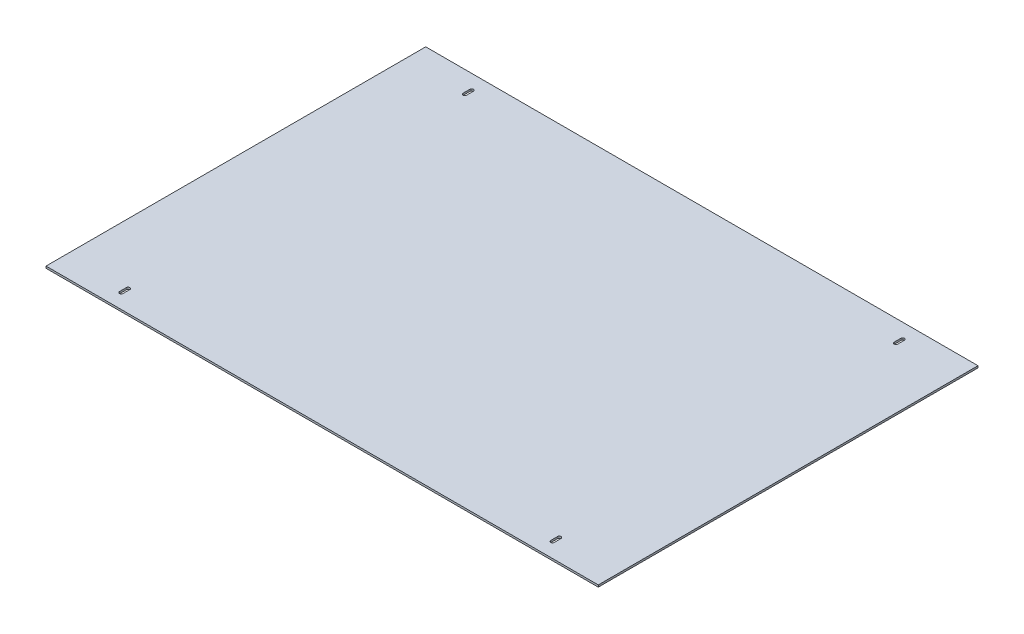
ISO-10303-21;
HEADER;
FILE_DESCRIPTION(('STEP AP214'),'2;1');
FILE_NAME('part.step','',(''),(''),'','','');
FILE_SCHEMA(('AUTOMOTIVE_DESIGN { 1 0 10303 214 1 1 1 1 }'));
ENDSEC;
DATA;
#1=APPLICATION_CONTEXT('core data for automotive mechanical design processes');
#2=APPLICATION_PROTOCOL_DEFINITION('international standard','automotive_design',2000,#1);
#3=PRODUCT_CONTEXT('',#1,'mechanical');
#4=PRODUCT('Part','Part','',(#3));
#5=PRODUCT_RELATED_PRODUCT_CATEGORY('part','',(#4));
#6=PRODUCT_DEFINITION_FORMATION('','',#4);
#7=PRODUCT_DEFINITION_CONTEXT('part definition',#1,'design');
#8=PRODUCT_DEFINITION('design','',#6,#7);
#9=PRODUCT_DEFINITION_SHAPE('','',#8);
#10=(LENGTH_UNIT() NAMED_UNIT(*) SI_UNIT(.MILLI.,.METRE.));
#11=(NAMED_UNIT(*) PLANE_ANGLE_UNIT() SI_UNIT($,.RADIAN.));
#12=(NAMED_UNIT(*) SI_UNIT($,.STERADIAN.) SOLID_ANGLE_UNIT());
#13=UNCERTAINTY_MEASURE_WITH_UNIT(LENGTH_MEASURE(1.E-05),#10,'distance_accuracy_value','');
#14=(GEOMETRIC_REPRESENTATION_CONTEXT(3) GLOBAL_UNCERTAINTY_ASSIGNED_CONTEXT((#13)) GLOBAL_UNIT_ASSIGNED_CONTEXT((#10,
#11,#12)) REPRESENTATION_CONTEXT('',''));
#15=CARTESIAN_POINT('',(0.,0.,0.));
#16=DIRECTION('',(0.,0.,1.));
#17=DIRECTION('',(1.,0.,0.));
#18=AXIS2_PLACEMENT_3D('',#15,#16,#17);
#19=CARTESIAN_POINT('',(357.886,2.54,246.0625));
#20=DIRECTION('',(-1.,0.,0.));
#21=DIRECTION('',(0.,0.,1.));
#22=AXIS2_PLACEMENT_3D('',#19,#20,#21);
#23=PLANE('',#22);
#24=DIRECTION('',(0.,0.,-1.));
#25=VECTOR('',#24,1.);
#26=CARTESIAN_POINT('',(357.886,0.,246.0625));
#27=LINE('',#26,#25);
#28=CARTESIAN_POINT('',(357.886,0.,246.0625));
#29=VERTEX_POINT('',#28);
#30=CARTESIAN_POINT('',(357.886,0.,-246.0625));
#31=VERTEX_POINT('',#30);
#32=EDGE_CURVE('E295',#29,#31,#27,.T.);
#33=ORIENTED_EDGE('',*,*,#32,.T.);
#34=DIRECTION('',(0.,-1.,0.));
#35=VECTOR('',#34,1.);
#36=CARTESIAN_POINT('',(357.886,2.54,-246.0625));
#37=LINE('',#36,#35);
#38=CARTESIAN_POINT('',(357.886,2.54,-246.0625));
#39=VERTEX_POINT('',#38);
#40=EDGE_CURVE('E11',#39,#31,#37,.T.);
#41=ORIENTED_EDGE('',*,*,#40,.F.);
#42=DIRECTION('',(0.,0.,-1.));
#43=VECTOR('',#42,1.);
#44=CARTESIAN_POINT('',(357.886,2.54,246.0625));
#45=LINE('',#44,#43);
#46=CARTESIAN_POINT('',(357.886,2.54,246.0625));
#47=VERTEX_POINT('',#46);
#48=EDGE_CURVE('E302',#47,#39,#45,.T.);
#49=ORIENTED_EDGE('',*,*,#48,.F.);
#50=DIRECTION('',(0.,-1.,0.));
#51=VECTOR('',#50,1.);
#52=CARTESIAN_POINT('',(357.886,2.54,246.0625));
#53=LINE('',#52,#51);
#54=EDGE_CURVE('E312',#47,#29,#53,.T.);
#55=ORIENTED_EDGE('',*,*,#54,.T.);
#56=EDGE_LOOP('',(#33,#41,#49,#55));
#57=FACE_BOUND('',#56,.T.);
#58=ADVANCED_FACE('F33',(#57),#23,.F.);
#59=CARTESIAN_POINT('',(-357.886,2.54,-246.0625));
#60=DIRECTION('',(0.,0.,1.));
#61=DIRECTION('',(1.,0.,0.));
#62=AXIS2_PLACEMENT_3D('',#59,#60,#61);
#63=PLANE('',#62);
#64=DIRECTION('',(-1.,0.,0.));
#65=VECTOR('',#64,1.);
#66=CARTESIAN_POINT('',(-357.886,0.,-246.0625));
#67=LINE('',#66,#65);
#68=CARTESIAN_POINT('',(-357.886,0.,-246.0625));
#69=VERTEX_POINT('',#68);
#70=EDGE_CURVE('E315',#31,#69,#67,.T.);
#71=ORIENTED_EDGE('',*,*,#70,.T.);
#72=DIRECTION('',(0.,-1.,0.));
#73=VECTOR('',#72,1.);
#74=CARTESIAN_POINT('',(-357.886,2.54,-246.0625));
#75=LINE('',#74,#73);
#76=CARTESIAN_POINT('',(-357.886,2.54,-246.0625));
#77=VERTEX_POINT('',#76);
#78=EDGE_CURVE('E40',#77,#69,#75,.T.);
#79=ORIENTED_EDGE('',*,*,#78,.F.);
#80=DIRECTION('',(-1.,0.,0.));
#81=VECTOR('',#80,1.);
#82=CARTESIAN_POINT('',(-357.886,2.54,-246.0625));
#83=LINE('',#82,#81);
#84=EDGE_CURVE('E305',#39,#77,#83,.T.);
#85=ORIENTED_EDGE('',*,*,#84,.F.);
#86=ORIENTED_EDGE('',*,*,#40,.T.);
#87=EDGE_LOOP('',(#71,#79,#85,#86));
#88=FACE_BOUND('',#87,.T.);
#89=ADVANCED_FACE('F344',(#88),#63,.F.);
#90=CARTESIAN_POINT('',(-357.886,2.54,246.0625));
#91=DIRECTION('',(1.,0.,0.));
#92=DIRECTION('',(0.,0.,-1.));
#93=AXIS2_PLACEMENT_3D('',#90,#91,#92);
#94=PLANE('',#93);
#95=DIRECTION('',(0.,0.,1.));
#96=VECTOR('',#95,1.);
#97=CARTESIAN_POINT('',(-357.886,0.,246.0625));
#98=LINE('',#97,#96);
#99=CARTESIAN_POINT('',(-357.886,0.,246.0625));
#100=VERTEX_POINT('',#99);
#101=EDGE_CURVE('E317',#69,#100,#98,.T.);
#102=ORIENTED_EDGE('',*,*,#101,.T.);
#103=DIRECTION('',(0.,-1.,0.));
#104=VECTOR('',#103,1.);
#105=CARTESIAN_POINT('',(-357.886,2.54,246.0625));
#106=LINE('',#105,#104);
#107=CARTESIAN_POINT('',(-357.886,2.54,246.0625));
#108=VERTEX_POINT('',#107);
#109=EDGE_CURVE('E322',#108,#100,#106,.T.);
#110=ORIENTED_EDGE('',*,*,#109,.F.);
#111=DIRECTION('',(0.,0.,1.));
#112=VECTOR('',#111,1.);
#113=CARTESIAN_POINT('',(-357.886,2.54,246.0625));
#114=LINE('',#113,#112);
#115=EDGE_CURVE('E308',#77,#108,#114,.T.);
#116=ORIENTED_EDGE('',*,*,#115,.F.);
#117=ORIENTED_EDGE('',*,*,#78,.T.);
#118=EDGE_LOOP('',(#102,#110,#116,#117));
#119=FACE_BOUND('',#118,.T.);
#120=ADVANCED_FACE('F329',(#119),#94,.F.);
#121=CARTESIAN_POINT('',(-357.886,2.54,246.0625));
#122=DIRECTION('',(0.,0.,-1.));
#123=DIRECTION('',(-1.,0.,0.));
#124=AXIS2_PLACEMENT_3D('',#121,#122,#123);
#125=PLANE('',#124);
#126=DIRECTION('',(1.,0.,0.));
#127=VECTOR('',#126,1.);
#128=CARTESIAN_POINT('',(-357.886,0.,246.0625));
#129=LINE('',#128,#127);
#130=EDGE_CURVE('E306',#100,#29,#129,.T.);
#131=ORIENTED_EDGE('',*,*,#130,.T.);
#132=ORIENTED_EDGE('',*,*,#54,.F.);
#133=DIRECTION('',(1.,0.,0.));
#134=VECTOR('',#133,1.);
#135=CARTESIAN_POINT('',(-357.886,2.54,246.0625));
#136=LINE('',#135,#134);
#137=EDGE_CURVE('E310',#108,#47,#136,.T.);
#138=ORIENTED_EDGE('',*,*,#137,.F.);
#139=ORIENTED_EDGE('',*,*,#109,.T.);
#140=EDGE_LOOP('',(#131,#132,#138,#139));
#141=FACE_BOUND('',#140,.T.);
#142=ADVANCED_FACE('F337',(#141),#125,.F.);
#143=CARTESIAN_POINT('',(0.,2.54,0.));
#144=DIRECTION('',(0.,-1.,0.));
#145=DIRECTION('',(0.,0.,-1.));
#146=AXIS2_PLACEMENT_3D('',#143,#144,#145);
#147=PLANE('',#146);
#148=DIRECTION('',(0.,0.,1.));
#149=VECTOR('',#148,1.);
#150=CARTESIAN_POINT('',(-281.6479,2.54,218.1225));
#151=LINE('',#150,#149);
#152=CARTESIAN_POINT('',(-281.6479,2.54,218.1225));
#153=VERTEX_POINT('',#152);
#154=CARTESIAN_POINT('',(-281.6479,2.54,227.0125));
#155=VERTEX_POINT('',#154);
#156=EDGE_CURVE('E196',#153,#155,#151,.T.);
#157=ORIENTED_EDGE('',*,*,#156,.F.);
#158=CARTESIAN_POINT('',(-279.4,2.54,218.1225));
#159=DIRECTION('',(0.,1.,0.));
#160=DIRECTION('',(0.,0.,1.));
#161=AXIS2_PLACEMENT_3D('',#158,#159,#160);
#162=CIRCLE('',#161,2.24789999999997);
#163=CARTESIAN_POINT('',(-277.1521,2.54,218.1225));
#164=VERTEX_POINT('',#163);
#165=EDGE_CURVE('E47',#164,#153,#162,.T.);
#166=ORIENTED_EDGE('',*,*,#165,.F.);
#167=DIRECTION('',(0.,0.,-1.));
#168=VECTOR('',#167,1.);
#169=CARTESIAN_POINT('',(-277.1521,2.54,218.1225));
#170=LINE('',#169,#168);
#171=CARTESIAN_POINT('',(-277.1521,2.54,227.0125));
#172=VERTEX_POINT('',#171);
#173=EDGE_CURVE('E187',#172,#164,#170,.T.);
#174=ORIENTED_EDGE('',*,*,#173,.F.);
#175=CARTESIAN_POINT('',(-279.4,2.54,227.0125));
#176=DIRECTION('',(0.,1.,0.));
#177=DIRECTION('',(0.,0.,1.));
#178=AXIS2_PLACEMENT_3D('',#175,#176,#177);
#179=CIRCLE('',#178,2.24789999999997);
#180=EDGE_CURVE('E190',#155,#172,#179,.T.);
#181=ORIENTED_EDGE('',*,*,#180,.F.);
#182=EDGE_LOOP('',(#157,#166,#174,#181));
#183=FACE_BOUND('',#182,.T.);
#184=DIRECTION('',(0.,0.,1.));
#185=VECTOR('',#184,1.);
#186=CARTESIAN_POINT('',(277.1521,2.54,218.1225));
#187=LINE('',#186,#185);
#188=CARTESIAN_POINT('',(277.1521,2.54,218.1225));
#189=VERTEX_POINT('',#188);
#190=CARTESIAN_POINT('',(277.1521,2.54,227.0125));
#191=VERTEX_POINT('',#190);
#192=EDGE_CURVE('E221',#189,#191,#187,.T.);
#193=ORIENTED_EDGE('',*,*,#192,.F.);
#194=CARTESIAN_POINT('',(279.4,2.54,218.1225));
#195=DIRECTION('',(0.,1.,0.));
#196=DIRECTION('',(0.,0.,-1.));
#197=AXIS2_PLACEMENT_3D('',#194,#195,#196);
#198=CIRCLE('',#197,2.24789999999997);
#199=CARTESIAN_POINT('',(281.6479,2.54,218.1225));
#200=VERTEX_POINT('',#199);
#201=EDGE_CURVE('E202',#200,#189,#198,.T.);
#202=ORIENTED_EDGE('',*,*,#201,.F.);
#203=DIRECTION('',(0.,0.,-1.));
#204=VECTOR('',#203,1.);
#205=CARTESIAN_POINT('',(281.6479,2.54,218.1225));
#206=LINE('',#205,#204);
#207=CARTESIAN_POINT('',(281.6479,2.54,227.0125));
#208=VERTEX_POINT('',#207);
#209=EDGE_CURVE('E210',#208,#200,#206,.T.);
#210=ORIENTED_EDGE('',*,*,#209,.F.);
#211=CARTESIAN_POINT('',(279.4,2.54,227.0125));
#212=DIRECTION('',(0.,1.,0.));
#213=DIRECTION('',(0.,0.,-1.));
#214=AXIS2_PLACEMENT_3D('',#211,#212,#213);
#215=CIRCLE('',#214,2.24789999999997);
#216=EDGE_CURVE('E224',#191,#208,#215,.T.);
#217=ORIENTED_EDGE('',*,*,#216,.F.);
#218=EDGE_LOOP('',(#193,#202,#210,#217));
#219=FACE_BOUND('',#218,.T.);
#220=DIRECTION('',(0.,0.,-1.));
#221=VECTOR('',#220,1.);
#222=CARTESIAN_POINT('',(-277.1521,2.54,-218.1225));
#223=LINE('',#222,#221);
#224=CARTESIAN_POINT('',(-277.1521,2.54,-218.1225));
#225=VERTEX_POINT('',#224);
#226=CARTESIAN_POINT('',(-277.1521,2.54,-227.0125));
#227=VERTEX_POINT('',#226);
#228=EDGE_CURVE('E253',#225,#227,#223,.T.);
#229=ORIENTED_EDGE('',*,*,#228,.F.);
#230=CARTESIAN_POINT('',(-279.4,2.54,-218.1225));
#231=DIRECTION('',(0.,1.,0.));
#232=DIRECTION('',(0.,0.,-1.));
#233=AXIS2_PLACEMENT_3D('',#230,#231,#232);
#234=CIRCLE('',#233,2.24789999999997);
#235=CARTESIAN_POINT('',(-281.6479,2.54,-218.1225));
#236=VERTEX_POINT('',#235);
#237=EDGE_CURVE('E231',#236,#225,#234,.T.);
#238=ORIENTED_EDGE('',*,*,#237,.F.);
#239=DIRECTION('',(0.,0.,1.));
#240=VECTOR('',#239,1.);
#241=CARTESIAN_POINT('',(-281.6479,2.54,-218.1225));
#242=LINE('',#241,#240);
#243=CARTESIAN_POINT('',(-281.6479,2.54,-227.0125));
#244=VERTEX_POINT('',#243);
#245=EDGE_CURVE('E242',#244,#236,#242,.T.);
#246=ORIENTED_EDGE('',*,*,#245,.F.);
#247=CARTESIAN_POINT('',(-279.4,2.54,-227.0125));
#248=DIRECTION('',(0.,1.,0.));
#249=DIRECTION('',(0.,0.,-1.));
#250=AXIS2_PLACEMENT_3D('',#247,#248,#249);
#251=CIRCLE('',#250,2.24789999999997);
#252=EDGE_CURVE('E256',#227,#244,#251,.T.);
#253=ORIENTED_EDGE('',*,*,#252,.F.);
#254=EDGE_LOOP('',(#229,#238,#246,#253));
#255=FACE_BOUND('',#254,.T.);
#256=DIRECTION('',(0.,0.,-1.));
#257=VECTOR('',#256,1.);
#258=CARTESIAN_POINT('',(281.6479,2.54,-218.1225));
#259=LINE('',#258,#257);
#260=CARTESIAN_POINT('',(281.6479,2.54,-218.1225));
#261=VERTEX_POINT('',#260);
#262=CARTESIAN_POINT('',(281.6479,2.54,-227.0125));
#263=VERTEX_POINT('',#262);
#264=EDGE_CURVE('E285',#261,#263,#259,.T.);
#265=ORIENTED_EDGE('',*,*,#264,.F.);
#266=CARTESIAN_POINT('',(279.4,2.54,-218.1225));
#267=DIRECTION('',(0.,1.,0.));
#268=DIRECTION('',(0.,0.,1.));
#269=AXIS2_PLACEMENT_3D('',#266,#267,#268);
#270=CIRCLE('',#269,2.24789999999997);
#271=CARTESIAN_POINT('',(277.1521,2.54,-218.1225));
#272=VERTEX_POINT('',#271);
#273=EDGE_CURVE('E263',#272,#261,#270,.T.);
#274=ORIENTED_EDGE('',*,*,#273,.F.);
#275=DIRECTION('',(0.,0.,1.));
#276=VECTOR('',#275,1.);
#277=CARTESIAN_POINT('',(277.1521,2.54,-218.1225));
#278=LINE('',#277,#276);
#279=CARTESIAN_POINT('',(277.1521,2.54,-227.0125));
#280=VERTEX_POINT('',#279);
#281=EDGE_CURVE('E274',#280,#272,#278,.T.);
#282=ORIENTED_EDGE('',*,*,#281,.F.);
#283=CARTESIAN_POINT('',(279.4,2.54,-227.0125));
#284=DIRECTION('',(0.,1.,0.));
#285=DIRECTION('',(0.,0.,1.));
#286=AXIS2_PLACEMENT_3D('',#283,#284,#285);
#287=CIRCLE('',#286,2.24789999999997);
#288=EDGE_CURVE('E288',#263,#280,#287,.T.);
#289=ORIENTED_EDGE('',*,*,#288,.F.);
#290=EDGE_LOOP('',(#265,#274,#282,#289));
#291=FACE_BOUND('',#290,.T.);
#292=ORIENTED_EDGE('',*,*,#48,.T.);
#293=ORIENTED_EDGE('',*,*,#84,.T.);
#294=ORIENTED_EDGE('',*,*,#115,.T.);
#295=ORIENTED_EDGE('',*,*,#137,.T.);
#296=EDGE_LOOP('',(#292,#293,#294,#295));
#297=FACE_BOUND('',#296,.T.);
#298=ADVANCED_FACE('F343',(#183,#219,#255,#291,#297),#147,.F.);
#299=CARTESIAN_POINT('',(0.,0.,0.));
#300=DIRECTION('',(0.,-1.,0.));
#301=DIRECTION('',(0.,0.,-1.));
#302=AXIS2_PLACEMENT_3D('',#299,#300,#301);
#303=PLANE('',#302);
#304=CARTESIAN_POINT('',(-279.4,0.,218.1225));
#305=DIRECTION('',(0.,1.,0.));
#306=DIRECTION('',(0.,0.,1.));
#307=AXIS2_PLACEMENT_3D('',#304,#305,#306);
#308=CIRCLE('',#307,2.24789999999997);
#309=CARTESIAN_POINT('',(-277.1521,0.,218.1225));
#310=VERTEX_POINT('',#309);
#311=CARTESIAN_POINT('',(-281.6479,0.,218.1225));
#312=VERTEX_POINT('',#311);
#313=EDGE_CURVE('E171',#310,#312,#308,.T.);
#314=ORIENTED_EDGE('',*,*,#313,.T.);
#315=DIRECTION('',(0.,0.,1.));
#316=VECTOR('',#315,1.);
#317=CARTESIAN_POINT('',(-281.6479,0.,218.1225));
#318=LINE('',#317,#316);
#319=CARTESIAN_POINT('',(-281.6479,0.,227.0125));
#320=VERTEX_POINT('',#319);
#321=EDGE_CURVE('E180',#312,#320,#318,.T.);
#322=ORIENTED_EDGE('',*,*,#321,.T.);
#323=CARTESIAN_POINT('',(-279.4,0.,227.0125));
#324=DIRECTION('',(0.,1.,0.));
#325=DIRECTION('',(0.,0.,1.));
#326=AXIS2_PLACEMENT_3D('',#323,#324,#325);
#327=CIRCLE('',#326,2.24789999999997);
#328=CARTESIAN_POINT('',(-277.1521,0.,227.0125));
#329=VERTEX_POINT('',#328);
#330=EDGE_CURVE('E55',#320,#329,#327,.T.);
#331=ORIENTED_EDGE('',*,*,#330,.T.);
#332=DIRECTION('',(0.,0.,-1.));
#333=VECTOR('',#332,1.);
#334=CARTESIAN_POINT('',(-277.1521,0.,218.1225));
#335=LINE('',#334,#333);
#336=EDGE_CURVE('E177',#329,#310,#335,.T.);
#337=ORIENTED_EDGE('',*,*,#336,.T.);
#338=EDGE_LOOP('',(#314,#322,#331,#337));
#339=FACE_BOUND('',#338,.T.);
#340=CARTESIAN_POINT('',(279.4,0.,218.1225));
#341=DIRECTION('',(0.,1.,0.));
#342=DIRECTION('',(0.,0.,-1.));
#343=AXIS2_PLACEMENT_3D('',#340,#341,#342);
#344=CIRCLE('',#343,2.24789999999997);
#345=CARTESIAN_POINT('',(281.6479,0.,218.1225));
#346=VERTEX_POINT('',#345);
#347=CARTESIAN_POINT('',(277.1521,0.,218.1225));
#348=VERTEX_POINT('',#347);
#349=EDGE_CURVE('E206',#346,#348,#344,.T.);
#350=ORIENTED_EDGE('',*,*,#349,.T.);
#351=DIRECTION('',(0.,0.,1.));
#352=VECTOR('',#351,1.);
#353=CARTESIAN_POINT('',(277.1521,0.,218.1225));
#354=LINE('',#353,#352);
#355=CARTESIAN_POINT('',(277.1521,0.,227.0125));
#356=VERTEX_POINT('',#355);
#357=EDGE_CURVE('E209',#348,#356,#354,.T.);
#358=ORIENTED_EDGE('',*,*,#357,.T.);
#359=CARTESIAN_POINT('',(279.4,0.,227.0125));
#360=DIRECTION('',(0.,1.,0.));
#361=DIRECTION('',(0.,0.,-1.));
#362=AXIS2_PLACEMENT_3D('',#359,#360,#361);
#363=CIRCLE('',#362,2.24789999999997);
#364=CARTESIAN_POINT('',(281.6479,0.,227.0125));
#365=VERTEX_POINT('',#364);
#366=EDGE_CURVE('E213',#356,#365,#363,.T.);
#367=ORIENTED_EDGE('',*,*,#366,.T.);
#368=DIRECTION('',(0.,0.,-1.));
#369=VECTOR('',#368,1.);
#370=CARTESIAN_POINT('',(281.6479,0.,218.1225));
#371=LINE('',#370,#369);
#372=EDGE_CURVE('E216',#365,#346,#371,.T.);
#373=ORIENTED_EDGE('',*,*,#372,.T.);
#374=EDGE_LOOP('',(#350,#358,#367,#373));
#375=FACE_BOUND('',#374,.T.);
#376=CARTESIAN_POINT('',(-279.4,0.,-218.1225));
#377=DIRECTION('',(0.,1.,0.));
#378=DIRECTION('',(0.,0.,-1.));
#379=AXIS2_PLACEMENT_3D('',#376,#377,#378);
#380=CIRCLE('',#379,2.24789999999997);
#381=CARTESIAN_POINT('',(-281.6479,0.,-218.1225));
#382=VERTEX_POINT('',#381);
#383=CARTESIAN_POINT('',(-277.1521,0.,-218.1225));
#384=VERTEX_POINT('',#383);
#385=EDGE_CURVE('E238',#382,#384,#380,.T.);
#386=ORIENTED_EDGE('',*,*,#385,.T.);
#387=DIRECTION('',(0.,0.,-1.));
#388=VECTOR('',#387,1.);
#389=CARTESIAN_POINT('',(-277.1521,0.,-218.1225));
#390=LINE('',#389,#388);
#391=CARTESIAN_POINT('',(-277.1521,0.,-227.0125));
#392=VERTEX_POINT('',#391);
#393=EDGE_CURVE('E241',#384,#392,#390,.T.);
#394=ORIENTED_EDGE('',*,*,#393,.T.);
#395=CARTESIAN_POINT('',(-279.4,0.,-227.0125));
#396=DIRECTION('',(0.,1.,0.));
#397=DIRECTION('',(0.,0.,-1.));
#398=AXIS2_PLACEMENT_3D('',#395,#396,#397);
#399=CIRCLE('',#398,2.24789999999997);
#400=CARTESIAN_POINT('',(-281.6479,0.,-227.0125));
#401=VERTEX_POINT('',#400);
#402=EDGE_CURVE('E245',#392,#401,#399,.T.);
#403=ORIENTED_EDGE('',*,*,#402,.T.);
#404=DIRECTION('',(0.,0.,1.));
#405=VECTOR('',#404,1.);
#406=CARTESIAN_POINT('',(-281.6479,0.,-218.1225));
#407=LINE('',#406,#405);
#408=EDGE_CURVE('E248',#401,#382,#407,.T.);
#409=ORIENTED_EDGE('',*,*,#408,.T.);
#410=EDGE_LOOP('',(#386,#394,#403,#409));
#411=FACE_BOUND('',#410,.T.);
#412=CARTESIAN_POINT('',(279.4,0.,-218.1225));
#413=DIRECTION('',(0.,1.,0.));
#414=DIRECTION('',(0.,0.,1.));
#415=AXIS2_PLACEMENT_3D('',#412,#413,#414);
#416=CIRCLE('',#415,2.24789999999997);
#417=CARTESIAN_POINT('',(277.1521,0.,-218.1225));
#418=VERTEX_POINT('',#417);
#419=CARTESIAN_POINT('',(281.6479,0.,-218.1225));
#420=VERTEX_POINT('',#419);
#421=EDGE_CURVE('E270',#418,#420,#416,.T.);
#422=ORIENTED_EDGE('',*,*,#421,.T.);
#423=DIRECTION('',(0.,0.,-1.));
#424=VECTOR('',#423,1.);
#425=CARTESIAN_POINT('',(281.6479,0.,-218.1225));
#426=LINE('',#425,#424);
#427=CARTESIAN_POINT('',(281.6479,0.,-227.0125));
#428=VERTEX_POINT('',#427);
#429=EDGE_CURVE('E273',#420,#428,#426,.T.);
#430=ORIENTED_EDGE('',*,*,#429,.T.);
#431=CARTESIAN_POINT('',(279.4,0.,-227.0125));
#432=DIRECTION('',(0.,1.,0.));
#433=DIRECTION('',(0.,0.,1.));
#434=AXIS2_PLACEMENT_3D('',#431,#432,#433);
#435=CIRCLE('',#434,2.24789999999997);
#436=CARTESIAN_POINT('',(277.1521,0.,-227.0125));
#437=VERTEX_POINT('',#436);
#438=EDGE_CURVE('E277',#428,#437,#435,.T.);
#439=ORIENTED_EDGE('',*,*,#438,.T.);
#440=DIRECTION('',(0.,0.,1.));
#441=VECTOR('',#440,1.);
#442=CARTESIAN_POINT('',(277.1521,0.,-218.1225));
#443=LINE('',#442,#441);
#444=EDGE_CURVE('E280',#437,#418,#443,.T.);
#445=ORIENTED_EDGE('',*,*,#444,.T.);
#446=EDGE_LOOP('',(#422,#430,#439,#445));
#447=FACE_BOUND('',#446,.T.);
#448=ORIENTED_EDGE('',*,*,#32,.F.);
#449=ORIENTED_EDGE('',*,*,#130,.F.);
#450=ORIENTED_EDGE('',*,*,#101,.F.);
#451=ORIENTED_EDGE('',*,*,#70,.F.);
#452=EDGE_LOOP('',(#448,#449,#450,#451));
#453=FACE_BOUND('',#452,.T.);
#454=ADVANCED_FACE('F184',(#339,#375,#411,#447,#453),#303,.T.);
#455=CARTESIAN_POINT('',(279.4,0.,-218.1225));
#456=DIRECTION('',(0.,1.,0.));
#457=DIRECTION('',(0.,0.,1.));
#458=AXIS2_PLACEMENT_3D('',#455,#456,#457);
#459=CYLINDRICAL_SURFACE('',#458,2.24789999999997);
#460=ORIENTED_EDGE('',*,*,#273,.T.);
#461=DIRECTION('',(0.,1.,0.));
#462=VECTOR('',#461,1.);
#463=CARTESIAN_POINT('',(281.6479,0.,-218.1225));
#464=LINE('',#463,#462);
#465=EDGE_CURVE('E283',#420,#261,#464,.T.);
#466=ORIENTED_EDGE('',*,*,#465,.F.);
#467=ORIENTED_EDGE('',*,*,#421,.F.);
#468=DIRECTION('',(0.,1.,0.));
#469=VECTOR('',#468,1.);
#470=CARTESIAN_POINT('',(277.1521,0.,-218.1225));
#471=LINE('',#470,#469);
#472=EDGE_CURVE('E293',#418,#272,#471,.T.);
#473=ORIENTED_EDGE('',*,*,#472,.T.);
#474=EDGE_LOOP('',(#460,#466,#467,#473));
#475=FACE_BOUND('',#474,.T.);
#476=ADVANCED_FACE('F356',(#475),#459,.F.);
#477=CARTESIAN_POINT('',(277.1521,0.,-218.1225));
#478=DIRECTION('',(-1.,0.,0.));
#479=DIRECTION('',(0.,0.,1.));
#480=AXIS2_PLACEMENT_3D('',#477,#478,#479);
#481=PLANE('',#480);
#482=ORIENTED_EDGE('',*,*,#281,.T.);
#483=ORIENTED_EDGE('',*,*,#472,.F.);
#484=ORIENTED_EDGE('',*,*,#444,.F.);
#485=DIRECTION('',(0.,1.,0.));
#486=VECTOR('',#485,1.);
#487=CARTESIAN_POINT('',(277.1521,0.,-227.0125));
#488=LINE('',#487,#486);
#489=EDGE_CURVE('E296',#437,#280,#488,.T.);
#490=ORIENTED_EDGE('',*,*,#489,.T.);
#491=EDGE_LOOP('',(#482,#483,#484,#490));
#492=FACE_BOUND('',#491,.T.);
#493=ADVANCED_FACE('F362',(#492),#481,.F.);
#494=CARTESIAN_POINT('',(279.4,0.,-227.0125));
#495=DIRECTION('',(0.,1.,0.));
#496=DIRECTION('',(0.,0.,1.));
#497=AXIS2_PLACEMENT_3D('',#494,#495,#496);
#498=CYLINDRICAL_SURFACE('',#497,2.24789999999997);
#499=ORIENTED_EDGE('',*,*,#288,.T.);
#500=ORIENTED_EDGE('',*,*,#489,.F.);
#501=ORIENTED_EDGE('',*,*,#438,.F.);
#502=DIRECTION('',(0.,1.,0.));
#503=VECTOR('',#502,1.);
#504=CARTESIAN_POINT('',(281.6479,0.,-227.0125));
#505=LINE('',#504,#503);
#506=EDGE_CURVE('E298',#428,#263,#505,.T.);
#507=ORIENTED_EDGE('',*,*,#506,.T.);
#508=EDGE_LOOP('',(#499,#500,#501,#507));
#509=FACE_BOUND('',#508,.T.);
#510=ADVANCED_FACE('F368',(#509),#498,.F.);
#511=CARTESIAN_POINT('',(281.6479,0.,-218.1225));
#512=DIRECTION('',(1.,0.,0.));
#513=DIRECTION('',(0.,0.,-1.));
#514=AXIS2_PLACEMENT_3D('',#511,#512,#513);
#515=PLANE('',#514);
#516=ORIENTED_EDGE('',*,*,#264,.T.);
#517=ORIENTED_EDGE('',*,*,#506,.F.);
#518=ORIENTED_EDGE('',*,*,#429,.F.);
#519=ORIENTED_EDGE('',*,*,#465,.T.);
#520=EDGE_LOOP('',(#516,#517,#518,#519));
#521=FACE_BOUND('',#520,.T.);
#522=ADVANCED_FACE('F364',(#521),#515,.F.);
#523=CARTESIAN_POINT('',(-279.4,0.,-218.1225));
#524=DIRECTION('',(0.,1.,0.));
#525=DIRECTION('',(0.,0.,1.));
#526=AXIS2_PLACEMENT_3D('',#523,#524,#525);
#527=CYLINDRICAL_SURFACE('',#526,2.24789999999997);
#528=ORIENTED_EDGE('',*,*,#237,.T.);
#529=DIRECTION('',(0.,1.,0.));
#530=VECTOR('',#529,1.);
#531=CARTESIAN_POINT('',(-277.1521,0.,-218.1225));
#532=LINE('',#531,#530);
#533=EDGE_CURVE('E251',#384,#225,#532,.T.);
#534=ORIENTED_EDGE('',*,*,#533,.F.);
#535=ORIENTED_EDGE('',*,*,#385,.F.);
#536=DIRECTION('',(0.,1.,0.));
#537=VECTOR('',#536,1.);
#538=CARTESIAN_POINT('',(-281.6479,0.,-218.1225));
#539=LINE('',#538,#537);
#540=EDGE_CURVE('E261',#382,#236,#539,.T.);
#541=ORIENTED_EDGE('',*,*,#540,.T.);
#542=EDGE_LOOP('',(#528,#534,#535,#541));
#543=FACE_BOUND('',#542,.T.);
#544=ADVANCED_FACE('F367',(#543),#527,.F.);
#545=CARTESIAN_POINT('',(-281.6479,0.,-218.1225));
#546=DIRECTION('',(-1.,0.,0.));
#547=DIRECTION('',(0.,0.,1.));
#548=AXIS2_PLACEMENT_3D('',#545,#546,#547);
#549=PLANE('',#548);
#550=ORIENTED_EDGE('',*,*,#245,.T.);
#551=ORIENTED_EDGE('',*,*,#540,.F.);
#552=ORIENTED_EDGE('',*,*,#408,.F.);
#553=DIRECTION('',(0.,1.,0.));
#554=VECTOR('',#553,1.);
#555=CARTESIAN_POINT('',(-281.6479,0.,-227.0125));
#556=LINE('',#555,#554);
#557=EDGE_CURVE('E264',#401,#244,#556,.T.);
#558=ORIENTED_EDGE('',*,*,#557,.T.);
#559=EDGE_LOOP('',(#550,#551,#552,#558));
#560=FACE_BOUND('',#559,.T.);
#561=ADVANCED_FACE('F378',(#560),#549,.F.);
#562=CARTESIAN_POINT('',(-279.4,0.,-227.0125));
#563=DIRECTION('',(0.,1.,0.));
#564=DIRECTION('',(0.,0.,1.));
#565=AXIS2_PLACEMENT_3D('',#562,#563,#564);
#566=CYLINDRICAL_SURFACE('',#565,2.24789999999997);
#567=ORIENTED_EDGE('',*,*,#252,.T.);
#568=ORIENTED_EDGE('',*,*,#557,.F.);
#569=ORIENTED_EDGE('',*,*,#402,.F.);
#570=DIRECTION('',(0.,1.,0.));
#571=VECTOR('',#570,1.);
#572=CARTESIAN_POINT('',(-277.1521,0.,-227.0125));
#573=LINE('',#572,#571);
#574=EDGE_CURVE('E266',#392,#227,#573,.T.);
#575=ORIENTED_EDGE('',*,*,#574,.T.);
#576=EDGE_LOOP('',(#567,#568,#569,#575));
#577=FACE_BOUND('',#576,.T.);
#578=ADVANCED_FACE('F384',(#577),#566,.F.);
#579=CARTESIAN_POINT('',(-277.1521,0.,-218.1225));
#580=DIRECTION('',(1.,0.,0.));
#581=DIRECTION('',(0.,0.,-1.));
#582=AXIS2_PLACEMENT_3D('',#579,#580,#581);
#583=PLANE('',#582);
#584=ORIENTED_EDGE('',*,*,#228,.T.);
#585=ORIENTED_EDGE('',*,*,#574,.F.);
#586=ORIENTED_EDGE('',*,*,#393,.F.);
#587=ORIENTED_EDGE('',*,*,#533,.T.);
#588=EDGE_LOOP('',(#584,#585,#586,#587));
#589=FACE_BOUND('',#588,.T.);
#590=ADVANCED_FACE('F380',(#589),#583,.F.);
#591=CARTESIAN_POINT('',(279.4,0.,218.1225));
#592=DIRECTION('',(0.,1.,0.));
#593=DIRECTION('',(0.,0.,1.));
#594=AXIS2_PLACEMENT_3D('',#591,#592,#593);
#595=CYLINDRICAL_SURFACE('',#594,2.24789999999997);
#596=ORIENTED_EDGE('',*,*,#201,.T.);
#597=DIRECTION('',(0.,1.,0.));
#598=VECTOR('',#597,1.);
#599=CARTESIAN_POINT('',(277.1521,0.,218.1225));
#600=LINE('',#599,#598);
#601=EDGE_CURVE('E219',#348,#189,#600,.T.);
#602=ORIENTED_EDGE('',*,*,#601,.F.);
#603=ORIENTED_EDGE('',*,*,#349,.F.);
#604=DIRECTION('',(0.,1.,0.));
#605=VECTOR('',#604,1.);
#606=CARTESIAN_POINT('',(281.6479,0.,218.1225));
#607=LINE('',#606,#605);
#608=EDGE_CURVE('E229',#346,#200,#607,.T.);
#609=ORIENTED_EDGE('',*,*,#608,.T.);
#610=EDGE_LOOP('',(#596,#602,#603,#609));
#611=FACE_BOUND('',#610,.T.);
#612=ADVANCED_FACE('F383',(#611),#595,.F.);
#613=CARTESIAN_POINT('',(281.6479,0.,218.1225));
#614=DIRECTION('',(1.,0.,0.));
#615=DIRECTION('',(0.,0.,-1.));
#616=AXIS2_PLACEMENT_3D('',#613,#614,#615);
#617=PLANE('',#616);
#618=ORIENTED_EDGE('',*,*,#209,.T.);
#619=ORIENTED_EDGE('',*,*,#608,.F.);
#620=ORIENTED_EDGE('',*,*,#372,.F.);
#621=DIRECTION('',(0.,1.,0.));
#622=VECTOR('',#621,1.);
#623=CARTESIAN_POINT('',(281.6479,0.,227.0125));
#624=LINE('',#623,#622);
#625=EDGE_CURVE('E232',#365,#208,#624,.T.);
#626=ORIENTED_EDGE('',*,*,#625,.T.);
#627=EDGE_LOOP('',(#618,#619,#620,#626));
#628=FACE_BOUND('',#627,.T.);
#629=ADVANCED_FACE('F394',(#628),#617,.F.);
#630=CARTESIAN_POINT('',(279.4,0.,227.0125));
#631=DIRECTION('',(0.,1.,0.));
#632=DIRECTION('',(0.,0.,1.));
#633=AXIS2_PLACEMENT_3D('',#630,#631,#632);
#634=CYLINDRICAL_SURFACE('',#633,2.24789999999997);
#635=ORIENTED_EDGE('',*,*,#216,.T.);
#636=ORIENTED_EDGE('',*,*,#625,.F.);
#637=ORIENTED_EDGE('',*,*,#366,.F.);
#638=DIRECTION('',(0.,1.,0.));
#639=VECTOR('',#638,1.);
#640=CARTESIAN_POINT('',(277.1521,0.,227.0125));
#641=LINE('',#640,#639);
#642=EDGE_CURVE('E234',#356,#191,#641,.T.);
#643=ORIENTED_EDGE('',*,*,#642,.T.);
#644=EDGE_LOOP('',(#635,#636,#637,#643));
#645=FACE_BOUND('',#644,.T.);
#646=ADVANCED_FACE('F399',(#645),#634,.F.);
#647=CARTESIAN_POINT('',(277.1521,0.,218.1225));
#648=DIRECTION('',(-1.,0.,0.));
#649=DIRECTION('',(0.,0.,1.));
#650=AXIS2_PLACEMENT_3D('',#647,#648,#649);
#651=PLANE('',#650);
#652=ORIENTED_EDGE('',*,*,#192,.T.);
#653=ORIENTED_EDGE('',*,*,#642,.F.);
#654=ORIENTED_EDGE('',*,*,#357,.F.);
#655=ORIENTED_EDGE('',*,*,#601,.T.);
#656=EDGE_LOOP('',(#652,#653,#654,#655));
#657=FACE_BOUND('',#656,.T.);
#658=ADVANCED_FACE('F396',(#657),#651,.F.);
#659=CARTESIAN_POINT('',(-279.4,0.,218.1225));
#660=DIRECTION('',(0.,1.,0.));
#661=DIRECTION('',(0.,0.,1.));
#662=AXIS2_PLACEMENT_3D('',#659,#660,#661);
#663=CYLINDRICAL_SURFACE('',#662,2.24789999999997);
#664=ORIENTED_EDGE('',*,*,#165,.T.);
#665=DIRECTION('',(0.,1.,0.));
#666=VECTOR('',#665,1.);
#667=CARTESIAN_POINT('',(-281.6479,0.,218.1225));
#668=LINE('',#667,#666);
#669=EDGE_CURVE('E167',#312,#153,#668,.T.);
#670=ORIENTED_EDGE('',*,*,#669,.F.);
#671=ORIENTED_EDGE('',*,*,#313,.F.);
#672=DIRECTION('',(0.,1.,0.));
#673=VECTOR('',#672,1.);
#674=CARTESIAN_POINT('',(-277.1521,0.,218.1225));
#675=LINE('',#674,#673);
#676=EDGE_CURVE('E200',#310,#164,#675,.T.);
#677=ORIENTED_EDGE('',*,*,#676,.T.);
#678=EDGE_LOOP('',(#664,#670,#671,#677));
#679=FACE_BOUND('',#678,.T.);
#680=ADVANCED_FACE('F169',(#679),#663,.F.);
#681=CARTESIAN_POINT('',(-277.1521,0.,218.1225));
#682=DIRECTION('',(1.,0.,0.));
#683=DIRECTION('',(0.,0.,-1.));
#684=AXIS2_PLACEMENT_3D('',#681,#682,#683);
#685=PLANE('',#684);
#686=ORIENTED_EDGE('',*,*,#173,.T.);
#687=ORIENTED_EDGE('',*,*,#676,.F.);
#688=ORIENTED_EDGE('',*,*,#336,.F.);
#689=DIRECTION('',(0.,1.,0.));
#690=VECTOR('',#689,1.);
#691=CARTESIAN_POINT('',(-277.1521,0.,227.0125));
#692=LINE('',#691,#690);
#693=EDGE_CURVE('E203',#329,#172,#692,.T.);
#694=ORIENTED_EDGE('',*,*,#693,.T.);
#695=EDGE_LOOP('',(#686,#687,#688,#694));
#696=FACE_BOUND('',#695,.T.);
#697=ADVANCED_FACE('F409',(#696),#685,.F.);
#698=CARTESIAN_POINT('',(-279.4,0.,227.0125));
#699=DIRECTION('',(0.,1.,0.));
#700=DIRECTION('',(0.,0.,1.));
#701=AXIS2_PLACEMENT_3D('',#698,#699,#700);
#702=CYLINDRICAL_SURFACE('',#701,2.24789999999997);
#703=ORIENTED_EDGE('',*,*,#180,.T.);
#704=ORIENTED_EDGE('',*,*,#693,.F.);
#705=ORIENTED_EDGE('',*,*,#330,.F.);
#706=DIRECTION('',(0.,1.,0.));
#707=VECTOR('',#706,1.);
#708=CARTESIAN_POINT('',(-281.6479,0.,227.0125));
#709=LINE('',#708,#707);
#710=EDGE_CURVE('E176',#320,#155,#709,.T.);
#711=ORIENTED_EDGE('',*,*,#710,.T.);
#712=EDGE_LOOP('',(#703,#704,#705,#711));
#713=FACE_BOUND('',#712,.T.);
#714=ADVANCED_FACE('F412',(#713),#702,.F.);
#715=CARTESIAN_POINT('',(-281.6479,0.,218.1225));
#716=DIRECTION('',(-1.,0.,0.));
#717=DIRECTION('',(0.,0.,1.));
#718=AXIS2_PLACEMENT_3D('',#715,#716,#717);
#719=PLANE('',#718);
#720=ORIENTED_EDGE('',*,*,#156,.T.);
#721=ORIENTED_EDGE('',*,*,#710,.F.);
#722=ORIENTED_EDGE('',*,*,#321,.F.);
#723=ORIENTED_EDGE('',*,*,#669,.T.);
#724=EDGE_LOOP('',(#720,#721,#722,#723));
#725=FACE_BOUND('',#724,.T.);
#726=ADVANCED_FACE('F181',(#725),#719,.F.);
#727=CLOSED_SHELL('',(#58,#89,#120,#142,#298,#454,#476,#493,#510,#522,#544,#561,#578,#590,#612,
#629,#646,#658,#680,#697,#714,#726));
#728=MANIFOLD_SOLID_BREP('B2',#727);
#729=ADVANCED_BREP_SHAPE_REPRESENTATION('',(#18,#728),#14);
#730=SHAPE_DEFINITION_REPRESENTATION(#9,#729);
ENDSEC;
END-ISO-10303-21;
